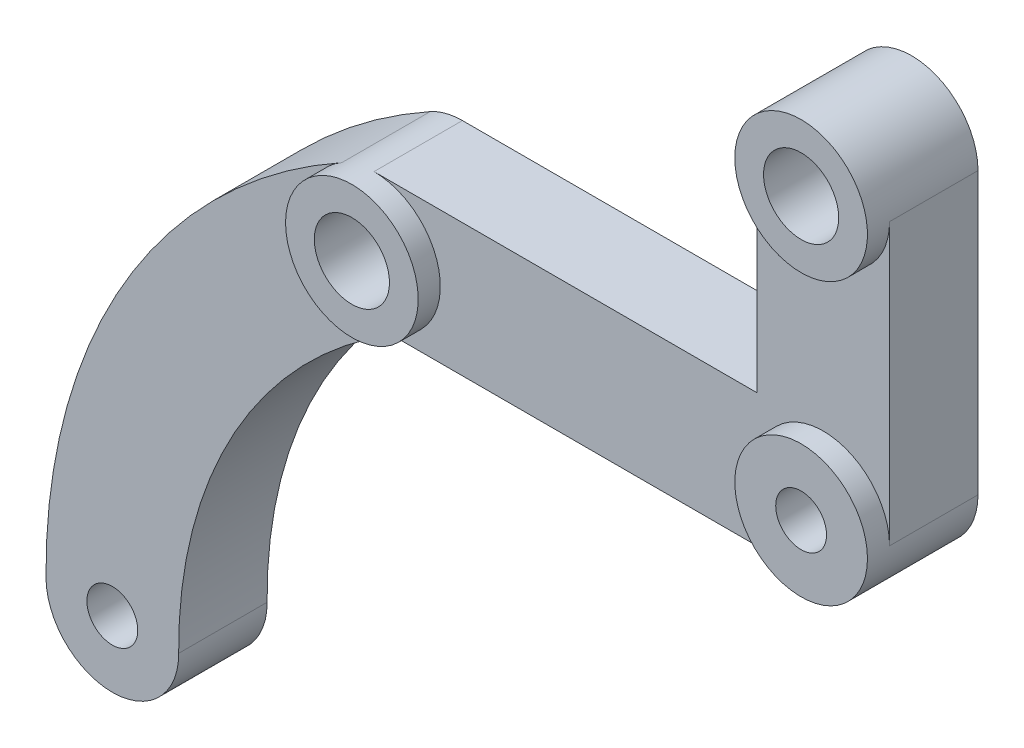
ISO-10303-21;
HEADER;
FILE_DESCRIPTION(('STEP AP214'),'2;1');
FILE_NAME('part.step','',(''),(''),'','','');
FILE_SCHEMA(('AUTOMOTIVE_DESIGN { 1 0 10303 214 1 1 1 1 }'));
ENDSEC;
DATA;
#1=APPLICATION_CONTEXT('core data for automotive mechanical design processes');
#2=APPLICATION_PROTOCOL_DEFINITION('international standard','automotive_design',2000,#1);
#3=PRODUCT_CONTEXT('',#1,'mechanical');
#4=PRODUCT('Part','Part','',(#3));
#5=PRODUCT_RELATED_PRODUCT_CATEGORY('part','',(#4));
#6=PRODUCT_DEFINITION_FORMATION('','',#4);
#7=PRODUCT_DEFINITION_CONTEXT('part definition',#1,'design');
#8=PRODUCT_DEFINITION('design','',#6,#7);
#9=PRODUCT_DEFINITION_SHAPE('','',#8);
#10=(LENGTH_UNIT() NAMED_UNIT(*) SI_UNIT(.MILLI.,.METRE.));
#11=(NAMED_UNIT(*) PLANE_ANGLE_UNIT() SI_UNIT($,.RADIAN.));
#12=(NAMED_UNIT(*) SI_UNIT($,.STERADIAN.) SOLID_ANGLE_UNIT());
#13=UNCERTAINTY_MEASURE_WITH_UNIT(LENGTH_MEASURE(1.E-05),#10,'distance_accuracy_value','');
#14=(GEOMETRIC_REPRESENTATION_CONTEXT(3) GLOBAL_UNCERTAINTY_ASSIGNED_CONTEXT((#13)) GLOBAL_UNIT_ASSIGNED_CONTEXT((#10,
#11,#12)) REPRESENTATION_CONTEXT('',''));
#15=CARTESIAN_POINT('',(0.,0.,0.));
#16=DIRECTION('',(0.,0.,1.));
#17=DIRECTION('',(1.,0.,0.));
#18=AXIS2_PLACEMENT_3D('',#15,#16,#17);
#19=CARTESIAN_POINT('',(-2.53999999999998,2.54000000000002,-5.));
#20=DIRECTION('',(0.,0.,1.));
#21=DIRECTION('',(-1.,0.,0.));
#22=AXIS2_PLACEMENT_3D('',#19,#20,#21);
#23=CYLINDRICAL_SURFACE('',#22,3.);
#24=CARTESIAN_POINT('',(-2.53999999999998,2.54000000000002,0.));
#25=DIRECTION('',(0.,0.,1.));
#26=DIRECTION('',(1.,0.,0.));
#27=AXIS2_PLACEMENT_3D('',#24,#25,#26);
#28=CIRCLE('',#27,3.);
#29=CARTESIAN_POINT('',(0.460000000000019,2.54000000000002,0.));
#30=VERTEX_POINT('',#29);
#31=EDGE_CURVE('E189',#30,#30,#28,.T.);
#32=ORIENTED_EDGE('',*,*,#31,.F.);
#33=EDGE_LOOP('',(#32));
#34=FACE_BOUND('',#33,.T.);
#35=CARTESIAN_POINT('',(-2.53999999999998,2.54000000000002,-5.));
#36=DIRECTION('',(0.,0.,1.));
#37=DIRECTION('',(1.,0.,0.));
#38=AXIS2_PLACEMENT_3D('',#35,#36,#37);
#39=CIRCLE('',#38,3.);
#40=CARTESIAN_POINT('',(-2.53999999999998,-0.459999999999989,-5.));
#41=VERTEX_POINT('',#40);
#42=CARTESIAN_POINT('',(0.460000000000041,2.54000000000002,-5.));
#43=VERTEX_POINT('',#42);
#44=EDGE_CURVE('E125',#41,#43,#39,.T.);
#45=ORIENTED_EDGE('',*,*,#44,.T.);
#46=DIRECTION('',(0.,0.,-1.));
#47=VECTOR('',#46,1.);
#48=CARTESIAN_POINT('',(0.460000000000041,2.54000000000002,14.0459958707099));
#49=LINE('',#48,#47);
#50=CARTESIAN_POINT('',(0.460000000000041,2.54000000000002,-1.00000000000001));
#51=VERTEX_POINT('',#50);
#52=EDGE_CURVE('E130',#51,#43,#49,.T.);
#53=ORIENTED_EDGE('',*,*,#52,.F.);
#54=CARTESIAN_POINT('',(-2.53999999999998,2.54000000000002,-1.00000000000001));
#55=DIRECTION('',(0.,0.,-1.));
#56=DIRECTION('',(-1.,0.,0.));
#57=AXIS2_PLACEMENT_3D('',#54,#55,#56);
#58=CIRCLE('',#57,3.);
#59=CARTESIAN_POINT('',(-2.53999999999998,-0.459999999999983,-1.00000000000001));
#60=VERTEX_POINT('',#59);
#61=EDGE_CURVE('E197',#60,#51,#58,.T.);
#62=ORIENTED_EDGE('',*,*,#61,.F.);
#63=DIRECTION('',(0.,0.,-1.));
#64=VECTOR('',#63,1.);
#65=CARTESIAN_POINT('',(-2.53999999999998,-0.459999999999983,20.1873169608612));
#66=LINE('',#65,#64);
#67=EDGE_CURVE('E143',#60,#41,#66,.T.);
#68=ORIENTED_EDGE('',*,*,#67,.T.);
#69=EDGE_LOOP('',(#45,#53,#62,#68));
#70=FACE_BOUND('',#69,.T.);
#71=ADVANCED_FACE('F39',(#34,#70),#23,.T.);
#72=CARTESIAN_POINT('',(-2.53999999999998,2.54000000000002,-5.00000000000013));
#73=DIRECTION('',(0.,0.,1.));
#74=DIRECTION('',(-1.,0.,0.));
#75=AXIS2_PLACEMENT_3D('',#72,#73,#74);
#76=CYLINDRICAL_SURFACE('',#75,1.15);
#77=CARTESIAN_POINT('',(-2.53999999999998,2.54000000000002,0.));
#78=DIRECTION('',(0.,0.,-1.));
#79=DIRECTION('',(-1.,0.,0.));
#80=AXIS2_PLACEMENT_3D('',#77,#78,#79);
#81=CIRCLE('',#80,1.15);
#82=CARTESIAN_POINT('',(-3.68999999999998,2.54000000000002,0.));
#83=VERTEX_POINT('',#82);
#84=EDGE_CURVE('E144',#83,#83,#81,.T.);
#85=ORIENTED_EDGE('',*,*,#84,.F.);
#86=EDGE_LOOP('',(#85));
#87=FACE_BOUND('',#86,.T.);
#88=CARTESIAN_POINT('',(-2.53999999999998,2.54000000000002,-5.));
#89=DIRECTION('',(0.,0.,1.));
#90=DIRECTION('',(1.,0.,0.));
#91=AXIS2_PLACEMENT_3D('',#88,#89,#90);
#92=CIRCLE('',#91,1.15);
#93=CARTESIAN_POINT('',(-1.38999999999998,2.54000000000002,-5.));
#94=VERTEX_POINT('',#93);
#95=EDGE_CURVE('E43',#94,#94,#92,.F.);
#96=ORIENTED_EDGE('',*,*,#95,.T.);
#97=EDGE_LOOP('',(#96));
#98=FACE_BOUND('',#97,.T.);
#99=ADVANCED_FACE('F268',(#87,#98),#76,.F.);
#100=CARTESIAN_POINT('',(-22.86,2.54000000000002,-5.));
#101=DIRECTION('',(0.,0.,1.));
#102=DIRECTION('',(-1.,0.,0.));
#103=AXIS2_PLACEMENT_3D('',#100,#101,#102);
#104=CYLINDRICAL_SURFACE('',#103,3.);
#105=DIRECTION('',(0.,0.,-1.));
#106=VECTOR('',#105,1.);
#107=CARTESIAN_POINT('',(-22.86,5.54000000000001,20.1873169608612));
#108=LINE('',#107,#106);
#109=CARTESIAN_POINT('',(-22.86,5.54000000000002,-1.00000000000008));
#110=VERTEX_POINT('',#109);
#111=CARTESIAN_POINT('',(-22.86,5.54000000000002,-5.));
#112=VERTEX_POINT('',#111);
#113=EDGE_CURVE('E174',#110,#112,#108,.T.);
#114=ORIENTED_EDGE('',*,*,#113,.T.);
#115=CARTESIAN_POINT('',(-22.86,2.54000000000002,-5.));
#116=DIRECTION('',(0.,0.,1.));
#117=DIRECTION('',(-1.,0.,0.));
#118=AXIS2_PLACEMENT_3D('',#115,#116,#117);
#119=CIRCLE('',#118,3.);
#120=CARTESIAN_POINT('',(-24.316166141175,5.16289537902209,-5.));
#121=VERTEX_POINT('',#120);
#122=EDGE_CURVE('E224',#112,#121,#119,.T.);
#123=ORIENTED_EDGE('',*,*,#122,.T.);
#124=DIRECTION('',(0.,0.,1.));
#125=VECTOR('',#124,1.);
#126=CARTESIAN_POINT('',(-24.3161661411749,5.1628953790221,-35.6297382465739));
#127=LINE('',#126,#125);
#128=CARTESIAN_POINT('',(-24.316166141175,5.1628953790221,-1.00000000000009));
#129=VERTEX_POINT('',#128);
#130=EDGE_CURVE('E212',#121,#129,#127,.T.);
#131=ORIENTED_EDGE('',*,*,#130,.T.);
#132=CARTESIAN_POINT('',(-22.86,2.54000000000002,-1.00000000000008));
#133=DIRECTION('',(0.,0.,1.));
#134=DIRECTION('',(1.,0.,0.));
#135=AXIS2_PLACEMENT_3D('',#132,#133,#134);
#136=CIRCLE('',#135,3.);
#137=EDGE_CURVE('E48',#129,#110,#136,.T.);
#138=ORIENTED_EDGE('',*,*,#137,.T.);
#139=EDGE_LOOP('',(#114,#123,#131,#138));
#140=FACE_BOUND('',#139,.T.);
#141=CARTESIAN_POINT('',(-22.86,2.54000000000002,0.));
#142=DIRECTION('',(0.,0.,1.));
#143=DIRECTION('',(-1.,0.,0.));
#144=AXIS2_PLACEMENT_3D('',#141,#142,#143);
#145=CIRCLE('',#144,3.);
#146=CARTESIAN_POINT('',(-25.86,2.54000000000002,0.));
#147=VERTEX_POINT('',#146);
#148=EDGE_CURVE('E225',#147,#147,#145,.T.);
#149=ORIENTED_EDGE('',*,*,#148,.F.);
#150=EDGE_LOOP('',(#149));
#151=FACE_BOUND('',#150,.T.);
#152=ADVANCED_FACE('F231',(#140,#151),#104,.T.);
#153=CARTESIAN_POINT('',(-22.86,2.54000000000002,-5.));
#154=DIRECTION('',(0.,0.,1.));
#155=DIRECTION('',(-1.,0.,0.));
#156=AXIS2_PLACEMENT_3D('',#153,#154,#155);
#157=PLANE('',#156);
#158=CARTESIAN_POINT('',(-34.6951410360899,-17.7744183979097,-5.00000000000012));
#159=DIRECTION('',(0.,0.,-1.));
#160=DIRECTION('',(-1.,0.,0.));
#161=AXIS2_PLACEMENT_3D('',#158,#159,#160);
#162=CIRCLE('',#161,1.14999999998194);
#163=CARTESIAN_POINT('',(-35.8451410360719,-17.7744183979097,-5.00000000000013));
#164=VERTEX_POINT('',#163);
#165=EDGE_CURVE('E151',#164,#164,#162,.T.);
#166=ORIENTED_EDGE('',*,*,#165,.F.);
#167=EDGE_LOOP('',(#166));
#168=FACE_BOUND('',#167,.T.);
#169=DIRECTION('',(1.,0.,0.));
#170=VECTOR('',#169,1.);
#171=CARTESIAN_POINT('',(-22.86,-0.459999999999981,-5.));
#172=LINE('',#171,#170);
#173=CARTESIAN_POINT('',(-22.0539914744157,-0.459999999999985,-5.));
#174=VERTEX_POINT('',#173);
#175=EDGE_CURVE('E160',#174,#41,#172,.T.);
#176=ORIENTED_EDGE('',*,*,#175,.F.);
#177=CARTESIAN_POINT('',(-11.6960595843246,-17.5688645725026,-5.));
#178=DIRECTION('',(0.,0.,1.));
#179=DIRECTION('',(1.,0.,0.));
#180=AXIS2_PLACEMENT_3D('',#177,#178,#179);
#181=CIRCLE('',#180,20.);
#182=CARTESIAN_POINT('',(-31.6952608467278,-17.7476070293783,-5.));
#183=VERTEX_POINT('',#182);
#184=EDGE_CURVE('E205',#174,#183,#181,.T.);
#185=ORIENTED_EDGE('',*,*,#184,.T.);
#186=CARTESIAN_POINT('',(-34.6951410360899,-17.7744183979097,-5.));
#187=DIRECTION('',(0.,0.,1.));
#188=DIRECTION('',(1.,0.,0.));
#189=AXIS2_PLACEMENT_3D('',#186,#187,#188);
#190=CIRCLE('',#189,2.99999999999978);
#191=CARTESIAN_POINT('',(-37.6950212254502,-17.8012297664411,-5.));
#192=VERTEX_POINT('',#191);
#193=EDGE_CURVE('E214',#183,#192,#190,.F.);
#194=ORIENTED_EDGE('',*,*,#193,.T.);
#195=CARTESIAN_POINT('',(-11.6960595843246,-17.5688645725026,-5.));
#196=DIRECTION('',(0.,0.,1.));
#197=DIRECTION('',(1.,0.,0.));
#198=AXIS2_PLACEMENT_3D('',#195,#196,#197);
#199=CIRCLE('',#198,25.9999999999998);
#200=EDGE_CURVE('E210',#192,#121,#199,.F.);
#201=ORIENTED_EDGE('',*,*,#200,.T.);
#202=ORIENTED_EDGE('',*,*,#122,.F.);
#203=DIRECTION('',(-1.,0.,0.));
#204=VECTOR('',#203,1.);
#205=CARTESIAN_POINT('',(-22.86,5.54000000000001,-5.));
#206=LINE('',#205,#204);
#207=CARTESIAN_POINT('',(-5.53999999999996,5.54000000000002,-5.));
#208=VERTEX_POINT('',#207);
#209=EDGE_CURVE('E63',#208,#112,#206,.T.);
#210=ORIENTED_EDGE('',*,*,#209,.F.);
#211=DIRECTION('',(0.,-1.,0.));
#212=VECTOR('',#211,1.);
#213=CARTESIAN_POINT('',(-5.53999999999996,15.24,-5.));
#214=LINE('',#213,#212);
#215=CARTESIAN_POINT('',(-5.53999999999996,15.24,-5.));
#216=VERTEX_POINT('',#215);
#217=EDGE_CURVE('E131',#216,#208,#214,.T.);
#218=ORIENTED_EDGE('',*,*,#217,.F.);
#219=CARTESIAN_POINT('',(-2.53999999999998,15.24,-5.));
#220=DIRECTION('',(0.,0.,1.));
#221=DIRECTION('',(-1.,0.,0.));
#222=AXIS2_PLACEMENT_3D('',#219,#220,#221);
#223=CIRCLE('',#222,3.);
#224=CARTESIAN_POINT('',(0.460000000000038,15.24,-5.));
#225=VERTEX_POINT('',#224);
#226=EDGE_CURVE('E128',#225,#216,#223,.T.);
#227=ORIENTED_EDGE('',*,*,#226,.F.);
#228=DIRECTION('',(0.,1.,0.));
#229=VECTOR('',#228,1.);
#230=CARTESIAN_POINT('',(0.460000000000038,15.24,-5.));
#231=LINE('',#230,#229);
#232=EDGE_CURVE('E120',#43,#225,#231,.T.);
#233=ORIENTED_EDGE('',*,*,#232,.F.);
#234=ORIENTED_EDGE('',*,*,#44,.F.);
#235=EDGE_LOOP('',(#176,#185,#194,#201,#202,#210,#218,#227,#233,#234));
#236=FACE_BOUND('',#235,.T.);
#237=ORIENTED_EDGE('',*,*,#95,.F.);
#238=EDGE_LOOP('',(#237));
#239=FACE_BOUND('',#238,.T.);
#240=ADVANCED_FACE('F41',(#168,#236,#239),#157,.F.);
#241=CARTESIAN_POINT('',(-22.86,2.54000000000002,0.));
#242=DIRECTION('',(0.,0.,1.));
#243=DIRECTION('',(-1.,0.,0.));
#244=AXIS2_PLACEMENT_3D('',#241,#242,#243);
#245=PLANE('',#244);
#246=CARTESIAN_POINT('',(-22.86,2.54000000000002,0.));
#247=DIRECTION('',(0.,0.,-1.));
#248=DIRECTION('',(1.,0.,0.));
#249=AXIS2_PLACEMENT_3D('',#246,#247,#248);
#250=CIRCLE('',#249,1.7);
#251=CARTESIAN_POINT('',(-21.16,2.54000000000002,0.));
#252=VERTEX_POINT('',#251);
#253=EDGE_CURVE('E164',#252,#252,#250,.T.);
#254=ORIENTED_EDGE('',*,*,#253,.T.);
#255=EDGE_LOOP('',(#254));
#256=FACE_BOUND('',#255,.T.);
#257=ORIENTED_EDGE('',*,*,#148,.T.);
#258=EDGE_LOOP('',(#257));
#259=FACE_BOUND('',#258,.T.);
#260=ADVANCED_FACE('F283',(#256,#259),#245,.T.);
#261=CARTESIAN_POINT('',(-11.6960595843246,-17.5688645725026,-1.00000000000004));
#262=DIRECTION('',(0.,0.,-1.));
#263=DIRECTION('',(1.,0.,0.));
#264=AXIS2_PLACEMENT_3D('',#261,#262,#263);
#265=PLANE('',#264);
#266=CARTESIAN_POINT('',(-34.6951410360899,-17.7744183979097,-1.00000000000012));
#267=DIRECTION('',(0.,0.,-1.));
#268=DIRECTION('',(-1.,0.,0.));
#269=AXIS2_PLACEMENT_3D('',#266,#267,#268);
#270=CIRCLE('',#269,1.14999999998194);
#271=CARTESIAN_POINT('',(-35.8451410360719,-17.7744183979097,-1.00000000000013));
#272=VERTEX_POINT('',#271);
#273=EDGE_CURVE('E147',#272,#272,#270,.T.);
#274=ORIENTED_EDGE('',*,*,#273,.T.);
#275=EDGE_LOOP('',(#274));
#276=FACE_BOUND('',#275,.T.);
#277=CARTESIAN_POINT('',(-11.6960595843246,-17.5688645725026,-1.00000000000004));
#278=DIRECTION('',(0.,0.,1.));
#279=DIRECTION('',(1.,0.,0.));
#280=AXIS2_PLACEMENT_3D('',#277,#278,#279);
#281=CIRCLE('',#280,20.);
#282=CARTESIAN_POINT('',(-22.0539914744157,-0.459999999999981,-1.00000000000008));
#283=VERTEX_POINT('',#282);
#284=CARTESIAN_POINT('',(-31.6952608467278,-17.7476070293783,-1.00000000000011));
#285=VERTEX_POINT('',#284);
#286=EDGE_CURVE('E206',#283,#285,#281,.T.);
#287=ORIENTED_EDGE('',*,*,#286,.F.);
#288=DIRECTION('',(1.,0.,0.));
#289=VECTOR('',#288,1.);
#290=CARTESIAN_POINT('',(-22.8599999999999,-0.459999999999981,-1.00000000000008));
#291=LINE('',#290,#289);
#292=EDGE_CURVE('E170',#283,#60,#291,.T.);
#293=ORIENTED_EDGE('',*,*,#292,.T.);
#294=ORIENTED_EDGE('',*,*,#61,.T.);
#295=DIRECTION('',(0.,1.,0.));
#296=VECTOR('',#295,1.);
#297=CARTESIAN_POINT('',(0.460000000000038,15.24,-0.999999999999999));
#298=LINE('',#297,#296);
#299=CARTESIAN_POINT('',(0.460000000000038,15.24,-0.999999999999999));
#300=VERTEX_POINT('',#299);
#301=EDGE_CURVE('E136',#51,#300,#298,.T.);
#302=ORIENTED_EDGE('',*,*,#301,.T.);
#303=CARTESIAN_POINT('',(-2.53999999999998,15.24,-1.00000000000001));
#304=DIRECTION('',(0.,0.,-1.));
#305=DIRECTION('',(-1.,0.,0.));
#306=AXIS2_PLACEMENT_3D('',#303,#304,#305);
#307=CIRCLE('',#306,3.);
#308=CARTESIAN_POINT('',(-5.53999999999996,15.24,-1.00000000000002));
#309=VERTEX_POINT('',#308);
#310=EDGE_CURVE('E181',#309,#300,#307,.F.);
#311=ORIENTED_EDGE('',*,*,#310,.F.);
#312=DIRECTION('',(0.,-1.,0.));
#313=VECTOR('',#312,1.);
#314=CARTESIAN_POINT('',(-5.53999999999996,15.24,-1.00000000000002));
#315=LINE('',#314,#313);
#316=CARTESIAN_POINT('',(-5.53999999999996,5.54000000000002,-1.00000000000002));
#317=VERTEX_POINT('',#316);
#318=EDGE_CURVE('E187',#309,#317,#315,.T.);
#319=ORIENTED_EDGE('',*,*,#318,.T.);
#320=DIRECTION('',(-1.,0.,0.));
#321=VECTOR('',#320,1.);
#322=CARTESIAN_POINT('',(-22.8599999999999,5.54000000000001,-1.00000000000008));
#323=LINE('',#322,#321);
#324=EDGE_CURVE('E55',#317,#110,#323,.T.);
#325=ORIENTED_EDGE('',*,*,#324,.T.);
#326=ORIENTED_EDGE('',*,*,#137,.F.);
#327=CARTESIAN_POINT('',(-11.6960595843246,-17.5688645725026,-1.00000000000004));
#328=DIRECTION('',(0.,0.,-1.));
#329=DIRECTION('',(1.,0.,0.));
#330=AXIS2_PLACEMENT_3D('',#327,#328,#329);
#331=CIRCLE('',#330,25.9999999999998);
#332=CARTESIAN_POINT('',(-37.6950212254502,-17.8012297664411,-1.00000000000013));
#333=VERTEX_POINT('',#332);
#334=EDGE_CURVE('E201',#333,#129,#331,.T.);
#335=ORIENTED_EDGE('',*,*,#334,.F.);
#336=CARTESIAN_POINT('',(-34.6951410360899,-17.7744183979097,-1.00000000000012));
#337=DIRECTION('',(0.,0.,-1.));
#338=DIRECTION('',(1.,0.,0.));
#339=AXIS2_PLACEMENT_3D('',#336,#337,#338);
#340=CIRCLE('',#339,2.99999999999978);
#341=EDGE_CURVE('E202',#285,#333,#340,.T.);
#342=ORIENTED_EDGE('',*,*,#341,.F.);
#343=EDGE_LOOP('',(#287,#293,#294,#302,#311,#319,#325,#326,#335,#342));
#344=FACE_BOUND('',#343,.T.);
#345=ADVANCED_FACE('F239',(#276,#344),#265,.F.);
#346=CARTESIAN_POINT('',(-11.6960595843245,-17.5688645725026,-35.6297382465738));
#347=DIRECTION('',(0.,0.,1.));
#348=DIRECTION('',(-1.,0.,0.));
#349=AXIS2_PLACEMENT_3D('',#346,#347,#348);
#350=CYLINDRICAL_SURFACE('',#349,20.);
#351=DIRECTION('',(0.,0.,1.));
#352=VECTOR('',#351,1.);
#353=CARTESIAN_POINT('',(-22.0539914744156,-0.45999999999998,-35.6297382465739));
#354=LINE('',#353,#352);
#355=EDGE_CURVE('E11',#174,#283,#354,.T.);
#356=ORIENTED_EDGE('',*,*,#355,.T.);
#357=ORIENTED_EDGE('',*,*,#286,.T.);
#358=DIRECTION('',(0.,0.,1.));
#359=VECTOR('',#358,1.);
#360=CARTESIAN_POINT('',(-31.6952608467277,-17.7476070293783,-35.6297382465739));
#361=LINE('',#360,#359);
#362=EDGE_CURVE('E217',#183,#285,#361,.T.);
#363=ORIENTED_EDGE('',*,*,#362,.F.);
#364=ORIENTED_EDGE('',*,*,#184,.F.);
#365=EDGE_LOOP('',(#356,#357,#363,#364));
#366=FACE_BOUND('',#365,.T.);
#367=ADVANCED_FACE('F249',(#366),#350,.F.);
#368=CARTESIAN_POINT('',(-34.6951410360898,-17.7744183979097,-35.6297382465739));
#369=DIRECTION('',(0.,0.,1.));
#370=DIRECTION('',(-1.,0.,0.));
#371=AXIS2_PLACEMENT_3D('',#368,#369,#370);
#372=CYLINDRICAL_SURFACE('',#371,2.99999999999978);
#373=ORIENTED_EDGE('',*,*,#362,.T.);
#374=ORIENTED_EDGE('',*,*,#341,.T.);
#375=DIRECTION('',(0.,0.,1.));
#376=VECTOR('',#375,1.);
#377=CARTESIAN_POINT('',(-37.6950212254501,-17.8012297664411,-35.6297382465739));
#378=LINE('',#377,#376);
#379=EDGE_CURVE('E213',#192,#333,#378,.T.);
#380=ORIENTED_EDGE('',*,*,#379,.F.);
#381=ORIENTED_EDGE('',*,*,#193,.F.);
#382=EDGE_LOOP('',(#373,#374,#380,#381));
#383=FACE_BOUND('',#382,.T.);
#384=ADVANCED_FACE('F287',(#383),#372,.T.);
#385=CARTESIAN_POINT('',(-11.6960595843245,-17.5688645725026,-35.6297382465738));
#386=DIRECTION('',(0.,0.,1.));
#387=DIRECTION('',(-1.,0.,0.));
#388=AXIS2_PLACEMENT_3D('',#385,#386,#387);
#389=CYLINDRICAL_SURFACE('',#388,25.9999999999998);
#390=ORIENTED_EDGE('',*,*,#379,.T.);
#391=ORIENTED_EDGE('',*,*,#334,.T.);
#392=ORIENTED_EDGE('',*,*,#130,.F.);
#393=ORIENTED_EDGE('',*,*,#200,.F.);
#394=EDGE_LOOP('',(#390,#391,#392,#393));
#395=FACE_BOUND('',#394,.T.);
#396=ADVANCED_FACE('F245',(#395),#389,.T.);
#397=CARTESIAN_POINT('',(-2.53999999999998,2.54000000000002,0.));
#398=DIRECTION('',(0.,0.,-1.));
#399=DIRECTION('',(1.,0.,0.));
#400=AXIS2_PLACEMENT_3D('',#397,#398,#399);
#401=PLANE('',#400);
#402=ORIENTED_EDGE('',*,*,#84,.T.);
#403=EDGE_LOOP('',(#402));
#404=FACE_BOUND('',#403,.T.);
#405=ORIENTED_EDGE('',*,*,#31,.T.);
#406=EDGE_LOOP('',(#405));
#407=FACE_BOUND('',#406,.T.);
#408=ADVANCED_FACE('F279',(#404,#407),#401,.F.);
#409=CARTESIAN_POINT('',(0.460000000000038,15.24,14.0459958707099));
#410=DIRECTION('',(1.,0.,0.));
#411=DIRECTION('',(0.,1.,0.));
#412=AXIS2_PLACEMENT_3D('',#409,#410,#411);
#413=PLANE('',#412);
#414=ORIENTED_EDGE('',*,*,#52,.T.);
#415=ORIENTED_EDGE('',*,*,#232,.T.);
#416=DIRECTION('',(0.,0.,-1.));
#417=VECTOR('',#416,1.);
#418=CARTESIAN_POINT('',(0.460000000000038,15.24,14.0459958707099));
#419=LINE('',#418,#417);
#420=EDGE_CURVE('E192',#300,#225,#419,.T.);
#421=ORIENTED_EDGE('',*,*,#420,.F.);
#422=ORIENTED_EDGE('',*,*,#301,.F.);
#423=EDGE_LOOP('',(#414,#415,#421,#422));
#424=FACE_BOUND('',#423,.T.);
#425=ADVANCED_FACE('F134',(#424),#413,.T.);
#426=CARTESIAN_POINT('',(-5.53999999999996,15.24,14.0459958707099));
#427=DIRECTION('',(-1.,0.,0.));
#428=DIRECTION('',(0.,-1.,0.));
#429=AXIS2_PLACEMENT_3D('',#426,#427,#428);
#430=PLANE('',#429);
#431=DIRECTION('',(0.,0.,1.));
#432=VECTOR('',#431,1.);
#433=CARTESIAN_POINT('',(-5.53999999999996,5.54000000000002,14.0459958707099));
#434=LINE('',#433,#432);
#435=EDGE_CURVE('E199',#208,#317,#434,.T.);
#436=ORIENTED_EDGE('',*,*,#435,.T.);
#437=ORIENTED_EDGE('',*,*,#318,.F.);
#438=DIRECTION('',(0.,0.,-1.));
#439=VECTOR('',#438,1.);
#440=CARTESIAN_POINT('',(-5.53999999999996,15.24,14.0459958707099));
#441=LINE('',#440,#439);
#442=EDGE_CURVE('E190',#309,#216,#441,.T.);
#443=ORIENTED_EDGE('',*,*,#442,.T.);
#444=ORIENTED_EDGE('',*,*,#217,.T.);
#445=EDGE_LOOP('',(#436,#437,#443,#444));
#446=FACE_BOUND('',#445,.T.);
#447=ADVANCED_FACE('F241',(#446),#430,.T.);
#448=CARTESIAN_POINT('',(-2.53999999999998,15.24,-5.));
#449=DIRECTION('',(0.,0.,1.));
#450=DIRECTION('',(-1.,0.,0.));
#451=AXIS2_PLACEMENT_3D('',#448,#449,#450);
#452=CYLINDRICAL_SURFACE('',#451,3.);
#453=ORIENTED_EDGE('',*,*,#420,.T.);
#454=ORIENTED_EDGE('',*,*,#226,.T.);
#455=ORIENTED_EDGE('',*,*,#442,.F.);
#456=ORIENTED_EDGE('',*,*,#310,.T.);
#457=EDGE_LOOP('',(#453,#454,#455,#456));
#458=FACE_BOUND('',#457,.T.);
#459=CARTESIAN_POINT('',(-2.53999999999998,15.24,0.));
#460=DIRECTION('',(0.,0.,1.));
#461=DIRECTION('',(-1.,0.,0.));
#462=AXIS2_PLACEMENT_3D('',#459,#460,#461);
#463=CIRCLE('',#462,3.);
#464=CARTESIAN_POINT('',(-5.53999999999998,15.24,0.));
#465=VERTEX_POINT('',#464);
#466=EDGE_CURVE('E178',#465,#465,#463,.T.);
#467=ORIENTED_EDGE('',*,*,#466,.F.);
#468=EDGE_LOOP('',(#467));
#469=FACE_BOUND('',#468,.T.);
#470=ADVANCED_FACE('F263',(#458,#469),#452,.T.);
#471=CARTESIAN_POINT('',(-2.53999999999998,15.24,0.));
#472=DIRECTION('',(0.,0.,1.));
#473=DIRECTION('',(-1.,0.,0.));
#474=AXIS2_PLACEMENT_3D('',#471,#472,#473);
#475=PLANE('',#474);
#476=CARTESIAN_POINT('',(-2.53999999999998,15.24,0.));
#477=DIRECTION('',(0.,0.,-1.));
#478=DIRECTION('',(-1.,0.,0.));
#479=AXIS2_PLACEMENT_3D('',#476,#477,#478);
#480=CIRCLE('',#479,1.7);
#481=CARTESIAN_POINT('',(-4.23999999999998,15.24,0.));
#482=VERTEX_POINT('',#481);
#483=EDGE_CURVE('E161',#482,#482,#480,.T.);
#484=ORIENTED_EDGE('',*,*,#483,.T.);
#485=EDGE_LOOP('',(#484));
#486=FACE_BOUND('',#485,.T.);
#487=ORIENTED_EDGE('',*,*,#466,.T.);
#488=EDGE_LOOP('',(#487));
#489=FACE_BOUND('',#488,.T.);
#490=ADVANCED_FACE('F255',(#486,#489),#475,.T.);
#491=CARTESIAN_POINT('',(-22.86,-0.459999999999981,20.1873169608612));
#492=DIRECTION('',(0.,-1.,0.));
#493=DIRECTION('',(1.,0.,0.));
#494=AXIS2_PLACEMENT_3D('',#491,#492,#493);
#495=PLANE('',#494);
#496=ORIENTED_EDGE('',*,*,#175,.T.);
#497=ORIENTED_EDGE('',*,*,#67,.F.);
#498=ORIENTED_EDGE('',*,*,#292,.F.);
#499=ORIENTED_EDGE('',*,*,#355,.F.);
#500=EDGE_LOOP('',(#496,#497,#498,#499));
#501=FACE_BOUND('',#500,.T.);
#502=ADVANCED_FACE('F253',(#501),#495,.T.);
#503=CARTESIAN_POINT('',(-22.86,5.54000000000001,20.1873169608612));
#504=DIRECTION('',(0.,1.,0.));
#505=DIRECTION('',(-1.,0.,0.));
#506=AXIS2_PLACEMENT_3D('',#503,#504,#505);
#507=PLANE('',#506);
#508=ORIENTED_EDGE('',*,*,#209,.T.);
#509=ORIENTED_EDGE('',*,*,#113,.F.);
#510=ORIENTED_EDGE('',*,*,#324,.F.);
#511=ORIENTED_EDGE('',*,*,#435,.F.);
#512=EDGE_LOOP('',(#508,#509,#510,#511));
#513=FACE_BOUND('',#512,.T.);
#514=ADVANCED_FACE('F235',(#513),#507,.T.);
#515=CARTESIAN_POINT('',(-2.53999999999998,15.24,-4.));
#516=DIRECTION('',(0.,0.,1.));
#517=DIRECTION('',(-1.,0.,0.));
#518=AXIS2_PLACEMENT_3D('',#515,#516,#517);
#519=CYLINDRICAL_SURFACE('',#518,1.7);
#520=CARTESIAN_POINT('',(-2.53999999999998,15.24,-4.));
#521=DIRECTION('',(0.,0.,-1.));
#522=DIRECTION('',(-1.,0.,0.));
#523=AXIS2_PLACEMENT_3D('',#520,#521,#522);
#524=CIRCLE('',#523,1.7);
#525=CARTESIAN_POINT('',(-4.23999999999998,15.24,-4.));
#526=VERTEX_POINT('',#525);
#527=EDGE_CURVE('E157',#526,#526,#524,.T.);
#528=ORIENTED_EDGE('',*,*,#527,.T.);
#529=EDGE_LOOP('',(#528));
#530=FACE_BOUND('',#529,.T.);
#531=ORIENTED_EDGE('',*,*,#483,.F.);
#532=EDGE_LOOP('',(#531));
#533=FACE_BOUND('',#532,.T.);
#534=ADVANCED_FACE('F261',(#530,#533),#519,.F.);
#535=CARTESIAN_POINT('',(-2.53999999999998,15.24,-4.));
#536=DIRECTION('',(0.,0.,1.));
#537=DIRECTION('',(-1.,0.,0.));
#538=AXIS2_PLACEMENT_3D('',#535,#536,#537);
#539=PLANE('',#538);
#540=ORIENTED_EDGE('',*,*,#527,.F.);
#541=EDGE_LOOP('',(#540));
#542=FACE_BOUND('',#541,.T.);
#543=ADVANCED_FACE('F306',(#542),#539,.T.);
#544=CARTESIAN_POINT('',(-22.86,2.54000000000002,-4.));
#545=DIRECTION('',(0.,0.,1.));
#546=DIRECTION('',(-1.,0.,0.));
#547=AXIS2_PLACEMENT_3D('',#544,#545,#546);
#548=CYLINDRICAL_SURFACE('',#547,1.7);
#549=CARTESIAN_POINT('',(-22.86,2.54000000000002,-4.));
#550=DIRECTION('',(0.,0.,-1.));
#551=DIRECTION('',(1.,0.,0.));
#552=AXIS2_PLACEMENT_3D('',#549,#550,#551);
#553=CIRCLE('',#552,1.7);
#554=CARTESIAN_POINT('',(-21.16,2.54000000000002,-4.));
#555=VERTEX_POINT('',#554);
#556=EDGE_CURVE('E154',#555,#555,#553,.T.);
#557=ORIENTED_EDGE('',*,*,#556,.T.);
#558=EDGE_LOOP('',(#557));
#559=FACE_BOUND('',#558,.T.);
#560=ORIENTED_EDGE('',*,*,#253,.F.);
#561=EDGE_LOOP('',(#560));
#562=FACE_BOUND('',#561,.T.);
#563=ADVANCED_FACE('F303',(#559,#562),#548,.F.);
#564=CARTESIAN_POINT('',(-22.86,2.54000000000002,-4.));
#565=DIRECTION('',(0.,0.,-1.));
#566=DIRECTION('',(1.,0.,0.));
#567=AXIS2_PLACEMENT_3D('',#564,#565,#566);
#568=PLANE('',#567);
#569=ORIENTED_EDGE('',*,*,#556,.F.);
#570=EDGE_LOOP('',(#569));
#571=FACE_BOUND('',#570,.T.);
#572=ADVANCED_FACE('F305',(#571),#568,.F.);
#573=CARTESIAN_POINT('',(-34.6951410360899,-17.7744183979097,-5.00000000000012));
#574=DIRECTION('',(0.,0.,1.));
#575=DIRECTION('',(-1.,0.,0.));
#576=AXIS2_PLACEMENT_3D('',#573,#574,#575);
#577=CYLINDRICAL_SURFACE('',#576,1.14999999998194);
#578=ORIENTED_EDGE('',*,*,#165,.T.);
#579=EDGE_LOOP('',(#578));
#580=FACE_BOUND('',#579,.T.);
#581=ORIENTED_EDGE('',*,*,#273,.F.);
#582=EDGE_LOOP('',(#581));
#583=FACE_BOUND('',#582,.T.);
#584=ADVANCED_FACE('F313',(#580,#583),#577,.F.);
#585=CLOSED_SHELL('',(#71,#99,#152,#240,#260,#345,#367,#384,#396,#408,#425,#447,#470,#490,#502,
#514,#534,#543,#563,#572,#584));
#586=MANIFOLD_SOLID_BREP('B2',#585);
#587=ADVANCED_BREP_SHAPE_REPRESENTATION('',(#18,#586),#14);
#588=SHAPE_DEFINITION_REPRESENTATION(#9,#587);
ENDSEC;
END-ISO-10303-21;
